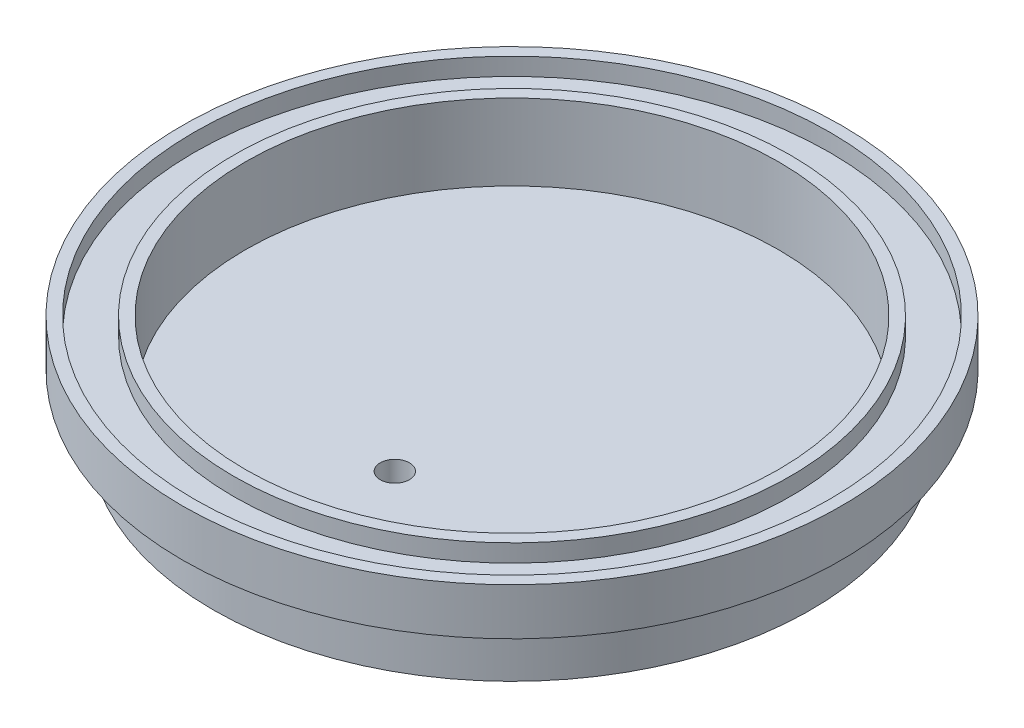
ISO-10303-21;
HEADER;
FILE_DESCRIPTION(('STEP AP214'),'2;1');
FILE_NAME('part.step','',(''),(''),'','','');
FILE_SCHEMA(('AUTOMOTIVE_DESIGN { 1 0 10303 214 1 1 1 1 }'));
ENDSEC;
DATA;
#1=APPLICATION_CONTEXT('core data for automotive mechanical design processes');
#2=APPLICATION_PROTOCOL_DEFINITION('international standard','automotive_design',2000,#1);
#3=PRODUCT_CONTEXT('',#1,'mechanical');
#4=PRODUCT('Part','Part','',(#3));
#5=PRODUCT_RELATED_PRODUCT_CATEGORY('part','',(#4));
#6=PRODUCT_DEFINITION_FORMATION('','',#4);
#7=PRODUCT_DEFINITION_CONTEXT('part definition',#1,'design');
#8=PRODUCT_DEFINITION('design','',#6,#7);
#9=PRODUCT_DEFINITION_SHAPE('','',#8);
#10=(LENGTH_UNIT() NAMED_UNIT(*) SI_UNIT(.MILLI.,.METRE.));
#11=(NAMED_UNIT(*) PLANE_ANGLE_UNIT() SI_UNIT($,.RADIAN.));
#12=(NAMED_UNIT(*) SI_UNIT($,.STERADIAN.) SOLID_ANGLE_UNIT());
#13=UNCERTAINTY_MEASURE_WITH_UNIT(LENGTH_MEASURE(1.E-05),#10,'distance_accuracy_value','');
#14=(GEOMETRIC_REPRESENTATION_CONTEXT(3) GLOBAL_UNCERTAINTY_ASSIGNED_CONTEXT((#13)) GLOBAL_UNIT_ASSIGNED_CONTEXT((#10,
#11,#12)) REPRESENTATION_CONTEXT('',''));
#15=CARTESIAN_POINT('',(0.,0.,0.));
#16=DIRECTION('',(0.,0.,1.));
#17=DIRECTION('',(1.,0.,0.));
#18=AXIS2_PLACEMENT_3D('',#15,#16,#17);
#19=CARTESIAN_POINT('',(0.,-5.,0.));
#20=DIRECTION('',(0.,1.,0.));
#21=DIRECTION('',(0.,0.,1.));
#22=AXIS2_PLACEMENT_3D('',#19,#20,#21);
#23=PLANE('',#22);
#24=CARTESIAN_POINT('',(0.,-5.,0.));
#25=DIRECTION('',(0.,1.,0.));
#26=DIRECTION('',(0.,0.,1.));
#27=AXIS2_PLACEMENT_3D('',#24,#25,#26);
#28=CIRCLE('',#27,56.25);
#29=CARTESIAN_POINT('',(0.,-5.,56.25));
#30=VERTEX_POINT('',#29);
#31=EDGE_CURVE('E126',#30,#30,#28,.T.);
#32=ORIENTED_EDGE('',*,*,#31,.F.);
#33=EDGE_LOOP('',(#32));
#34=FACE_BOUND('',#33,.T.);
#35=DIRECTION('',(0.,0.,-1.));
#36=VECTOR('',#35,1.);
#37=CARTESIAN_POINT('',(-2.34999999999999,-5.,-51.));
#38=LINE('',#37,#36);
#39=CARTESIAN_POINT('',(-2.34999999999999,-5.,-50.9458290736347));
#40=VERTEX_POINT('',#39);
#41=CARTESIAN_POINT('',(-2.34999999999999,-5.,-56.));
#42=VERTEX_POINT('',#41);
#43=EDGE_CURVE('E98',#40,#42,#38,.T.);
#44=ORIENTED_EDGE('',*,*,#43,.F.);
#45=CARTESIAN_POINT('',(0.,-5.,0.));
#46=DIRECTION('',(0.,1.,0.));
#47=DIRECTION('',(0.,0.,1.));
#48=AXIS2_PLACEMENT_3D('',#45,#46,#47);
#49=CIRCLE('',#48,51.);
#50=CARTESIAN_POINT('',(2.35000000000001,-5.,-50.9458290736347));
#51=VERTEX_POINT('',#50);
#52=EDGE_CURVE('E118',#40,#51,#49,.T.);
#53=ORIENTED_EDGE('',*,*,#52,.T.);
#54=DIRECTION('',(0.,0.,1.));
#55=VECTOR('',#54,1.);
#56=CARTESIAN_POINT('',(2.35000000000001,-5.,-51.));
#57=LINE('',#56,#55);
#58=CARTESIAN_POINT('',(2.35000000000001,-5.,-56.));
#59=VERTEX_POINT('',#58);
#60=EDGE_CURVE('E92',#59,#51,#57,.T.);
#61=ORIENTED_EDGE('',*,*,#60,.F.);
#62=DIRECTION('',(1.,0.,0.));
#63=VECTOR('',#62,1.);
#64=CARTESIAN_POINT('',(-2.34999999999999,-5.,-56.));
#65=LINE('',#64,#63);
#66=EDGE_CURVE('E111',#42,#59,#65,.T.);
#67=ORIENTED_EDGE('',*,*,#66,.F.);
#68=EDGE_LOOP('',(#44,#53,#61,#67));
#69=FACE_BOUND('',#68,.T.);
#70=ADVANCED_FACE('F48',(#34,#69),#23,.F.);
#71=CARTESIAN_POINT('',(0.,-15.,0.));
#72=DIRECTION('',(0.,1.,0.));
#73=DIRECTION('',(0.,0.,1.));
#74=AXIS2_PLACEMENT_3D('',#71,#72,#73);
#75=CYLINDRICAL_SURFACE('',#74,51.);
#76=CARTESIAN_POINT('',(0.,-15.,0.));
#77=DIRECTION('',(0.,1.,0.));
#78=DIRECTION('',(0.,0.,1.));
#79=AXIS2_PLACEMENT_3D('',#76,#77,#78);
#80=CIRCLE('',#79,51.);
#81=CARTESIAN_POINT('',(0.,-15.,51.));
#82=VERTEX_POINT('',#81);
#83=EDGE_CURVE('E101',#82,#82,#80,.T.);
#84=ORIENTED_EDGE('',*,*,#83,.T.);
#85=EDGE_LOOP('',(#84));
#86=FACE_BOUND('',#85,.T.);
#87=ORIENTED_EDGE('',*,*,#52,.F.);
#88=DIRECTION('',(0.,1.,0.));
#89=VECTOR('',#88,1.);
#90=CARTESIAN_POINT('',(-2.34999999999999,-15.,-50.9458290736347));
#91=LINE('',#90,#89);
#92=CARTESIAN_POINT('',(-2.34999999999999,-10.,-50.9458290736347));
#93=VERTEX_POINT('',#92);
#94=EDGE_CURVE('E12',#40,#93,#91,.F.);
#95=ORIENTED_EDGE('',*,*,#94,.T.);
#96=CARTESIAN_POINT('',(0.,-10.,0.));
#97=DIRECTION('',(0.,1.,0.));
#98=DIRECTION('',(0.,0.,1.));
#99=AXIS2_PLACEMENT_3D('',#96,#97,#98);
#100=CIRCLE('',#99,51.);
#101=CARTESIAN_POINT('',(2.35000000000001,-10.,-50.9458290736347));
#102=VERTEX_POINT('',#101);
#103=EDGE_CURVE('E68',#93,#102,#100,.F.);
#104=ORIENTED_EDGE('',*,*,#103,.T.);
#105=DIRECTION('',(0.,1.,0.));
#106=VECTOR('',#105,1.);
#107=CARTESIAN_POINT('',(2.35000000000001,-15.,-50.9458290736347));
#108=LINE('',#107,#106);
#109=EDGE_CURVE('E56',#102,#51,#108,.T.);
#110=ORIENTED_EDGE('',*,*,#109,.T.);
#111=EDGE_LOOP('',(#87,#95,#104,#110));
#112=FACE_BOUND('',#111,.T.);
#113=ADVANCED_FACE('F145',(#86,#112),#75,.T.);
#114=CARTESIAN_POINT('',(0.,3.,0.));
#115=DIRECTION('',(0.,-1.,0.));
#116=DIRECTION('',(0.,0.,-1.));
#117=AXIS2_PLACEMENT_3D('',#114,#115,#116);
#118=CYLINDRICAL_SURFACE('',#117,54.25);
#119=CARTESIAN_POINT('',(0.,3.,0.));
#120=DIRECTION('',(0.,1.,0.));
#121=DIRECTION('',(0.,0.,1.));
#122=AXIS2_PLACEMENT_3D('',#119,#120,#121);
#123=CIRCLE('',#122,54.25);
#124=CARTESIAN_POINT('',(0.,3.,54.25));
#125=VERTEX_POINT('',#124);
#126=EDGE_CURVE('E132',#125,#125,#123,.T.);
#127=ORIENTED_EDGE('',*,*,#126,.T.);
#128=EDGE_LOOP('',(#127));
#129=FACE_BOUND('',#128,.T.);
#130=CARTESIAN_POINT('',(0.,0.,0.));
#131=DIRECTION('',(0.,1.,0.));
#132=DIRECTION('',(0.,0.,1.));
#133=AXIS2_PLACEMENT_3D('',#130,#131,#132);
#134=CIRCLE('',#133,54.25);
#135=CARTESIAN_POINT('',(0.,0.,54.25));
#136=VERTEX_POINT('',#135);
#137=EDGE_CURVE('E131',#136,#136,#134,.T.);
#138=ORIENTED_EDGE('',*,*,#137,.F.);
#139=EDGE_LOOP('',(#138));
#140=FACE_BOUND('',#139,.T.);
#141=ADVANCED_FACE('F50',(#129,#140),#118,.F.);
#142=CARTESIAN_POINT('',(0.,3.,0.));
#143=DIRECTION('',(0.,-1.,0.));
#144=DIRECTION('',(0.,0.,-1.));
#145=AXIS2_PLACEMENT_3D('',#142,#143,#144);
#146=CYLINDRICAL_SURFACE('',#145,56.25);
#147=CARTESIAN_POINT('',(0.,3.,0.));
#148=DIRECTION('',(0.,1.,0.));
#149=DIRECTION('',(0.,0.,1.));
#150=AXIS2_PLACEMENT_3D('',#147,#148,#149);
#151=CIRCLE('',#150,56.25);
#152=CARTESIAN_POINT('',(0.,3.,56.25));
#153=VERTEX_POINT('',#152);
#154=EDGE_CURVE('E135',#153,#153,#151,.T.);
#155=ORIENTED_EDGE('',*,*,#154,.F.);
#156=EDGE_LOOP('',(#155));
#157=FACE_BOUND('',#156,.T.);
#158=ORIENTED_EDGE('',*,*,#31,.T.);
#159=EDGE_LOOP('',(#158));
#160=FACE_BOUND('',#159,.T.);
#161=ADVANCED_FACE('F179',(#157,#160),#146,.T.);
#162=CARTESIAN_POINT('',(0.,3.,0.));
#163=DIRECTION('',(0.,1.,0.));
#164=DIRECTION('',(0.,0.,1.));
#165=AXIS2_PLACEMENT_3D('',#162,#163,#164);
#166=PLANE('',#165);
#167=ORIENTED_EDGE('',*,*,#126,.F.);
#168=EDGE_LOOP('',(#167));
#169=FACE_BOUND('',#168,.T.);
#170=ORIENTED_EDGE('',*,*,#154,.T.);
#171=EDGE_LOOP('',(#170));
#172=FACE_BOUND('',#171,.T.);
#173=ADVANCED_FACE('F176',(#169,#172),#166,.T.);
#174=CARTESIAN_POINT('',(0.,0.,0.));
#175=DIRECTION('',(0.,1.,0.));
#176=DIRECTION('',(0.,0.,1.));
#177=AXIS2_PLACEMENT_3D('',#174,#175,#176);
#178=PLANE('',#177);
#179=ORIENTED_EDGE('',*,*,#137,.T.);
#180=EDGE_LOOP('',(#179));
#181=FACE_BOUND('',#180,.T.);
#182=CARTESIAN_POINT('',(0.,0.,0.));
#183=DIRECTION('',(0.,1.,0.));
#184=DIRECTION('',(0.,0.,1.));
#185=AXIS2_PLACEMENT_3D('',#182,#183,#184);
#186=CIRCLE('',#185,47.5);
#187=CARTESIAN_POINT('',(0.,0.,47.5));
#188=VERTEX_POINT('',#187);
#189=EDGE_CURVE('E123',#188,#188,#186,.T.);
#190=ORIENTED_EDGE('',*,*,#189,.F.);
#191=EDGE_LOOP('',(#190));
#192=FACE_BOUND('',#191,.T.);
#193=ADVANCED_FACE('F173',(#181,#192),#178,.T.);
#194=CARTESIAN_POINT('',(0.,3.,0.));
#195=DIRECTION('',(0.,-1.,0.));
#196=DIRECTION('',(0.,0.,-1.));
#197=AXIS2_PLACEMENT_3D('',#194,#195,#196);
#198=CYLINDRICAL_SURFACE('',#197,45.5);
#199=CARTESIAN_POINT('',(0.,3.,0.));
#200=DIRECTION('',(0.,1.,0.));
#201=DIRECTION('',(0.,0.,1.));
#202=AXIS2_PLACEMENT_3D('',#199,#200,#201);
#203=CIRCLE('',#202,45.5);
#204=CARTESIAN_POINT('',(0.,3.,45.5));
#205=VERTEX_POINT('',#204);
#206=EDGE_CURVE('E119',#205,#205,#203,.T.);
#207=ORIENTED_EDGE('',*,*,#206,.T.);
#208=EDGE_LOOP('',(#207));
#209=FACE_BOUND('',#208,.T.);
#210=CARTESIAN_POINT('',(0.,-10.,0.));
#211=DIRECTION('',(0.,1.,0.));
#212=DIRECTION('',(0.,0.,1.));
#213=AXIS2_PLACEMENT_3D('',#210,#211,#212);
#214=CIRCLE('',#213,45.5);
#215=CARTESIAN_POINT('',(0.,-10.,45.5));
#216=VERTEX_POINT('',#215);
#217=EDGE_CURVE('E112',#216,#216,#214,.T.);
#218=ORIENTED_EDGE('',*,*,#217,.F.);
#219=EDGE_LOOP('',(#218));
#220=FACE_BOUND('',#219,.T.);
#221=ADVANCED_FACE('F171',(#209,#220),#198,.F.);
#222=CARTESIAN_POINT('',(0.,3.,0.));
#223=DIRECTION('',(0.,-1.,0.));
#224=DIRECTION('',(0.,0.,-1.));
#225=AXIS2_PLACEMENT_3D('',#222,#223,#224);
#226=CYLINDRICAL_SURFACE('',#225,47.5);
#227=CARTESIAN_POINT('',(0.,3.,0.));
#228=DIRECTION('',(0.,1.,0.));
#229=DIRECTION('',(0.,0.,1.));
#230=AXIS2_PLACEMENT_3D('',#227,#228,#229);
#231=CIRCLE('',#230,47.5);
#232=CARTESIAN_POINT('',(0.,3.,47.5));
#233=VERTEX_POINT('',#232);
#234=EDGE_CURVE('E122',#233,#233,#231,.T.);
#235=ORIENTED_EDGE('',*,*,#234,.F.);
#236=EDGE_LOOP('',(#235));
#237=FACE_BOUND('',#236,.T.);
#238=ORIENTED_EDGE('',*,*,#189,.T.);
#239=EDGE_LOOP('',(#238));
#240=FACE_BOUND('',#239,.T.);
#241=ADVANCED_FACE('F198',(#237,#240),#226,.T.);
#242=CARTESIAN_POINT('',(0.,3.,0.));
#243=DIRECTION('',(0.,1.,0.));
#244=DIRECTION('',(0.,0.,1.));
#245=AXIS2_PLACEMENT_3D('',#242,#243,#244);
#246=PLANE('',#245);
#247=ORIENTED_EDGE('',*,*,#206,.F.);
#248=EDGE_LOOP('',(#247));
#249=FACE_BOUND('',#248,.T.);
#250=ORIENTED_EDGE('',*,*,#234,.T.);
#251=EDGE_LOOP('',(#250));
#252=FACE_BOUND('',#251,.T.);
#253=ADVANCED_FACE('F200',(#249,#252),#246,.T.);
#254=CARTESIAN_POINT('',(0.,-15.,0.));
#255=DIRECTION('',(0.,1.,0.));
#256=DIRECTION('',(0.,0.,1.));
#257=AXIS2_PLACEMENT_3D('',#254,#255,#256);
#258=PLANE('',#257);
#259=CARTESIAN_POINT('',(0.,-15.,20.));
#260=DIRECTION('',(0.,1.,0.));
#261=DIRECTION('',(0.,0.,1.));
#262=AXIS2_PLACEMENT_3D('',#259,#260,#261);
#263=CIRCLE('',#262,2.5);
#264=CARTESIAN_POINT('',(0.,-15.,22.5));
#265=VERTEX_POINT('',#264);
#266=EDGE_CURVE('E272',#265,#265,#263,.T.);
#267=ORIENTED_EDGE('',*,*,#266,.T.);
#268=EDGE_LOOP('',(#267));
#269=FACE_BOUND('',#268,.T.);
#270=ORIENTED_EDGE('',*,*,#83,.F.);
#271=EDGE_LOOP('',(#270));
#272=FACE_BOUND('',#271,.T.);
#273=ADVANCED_FACE('F204',(#269,#272),#258,.F.);
#274=CARTESIAN_POINT('',(-2.34999999999999,-10.,-51.));
#275=DIRECTION('',(1.,0.,0.));
#276=DIRECTION('',(0.,0.,-1.));
#277=AXIS2_PLACEMENT_3D('',#274,#275,#276);
#278=PLANE('',#277);
#279=ORIENTED_EDGE('',*,*,#94,.F.);
#280=ORIENTED_EDGE('',*,*,#43,.T.);
#281=DIRECTION('',(0.,1.,0.));
#282=VECTOR('',#281,1.);
#283=CARTESIAN_POINT('',(-2.34999999999999,-10.,-56.));
#284=LINE('',#283,#282);
#285=CARTESIAN_POINT('',(-2.34999999999999,-10.,-56.));
#286=VERTEX_POINT('',#285);
#287=EDGE_CURVE('E95',#286,#42,#284,.T.);
#288=ORIENTED_EDGE('',*,*,#287,.F.);
#289=DIRECTION('',(0.,0.,-1.));
#290=VECTOR('',#289,1.);
#291=CARTESIAN_POINT('',(-2.34999999999999,-10.,-51.));
#292=LINE('',#291,#290);
#293=EDGE_CURVE('E85',#93,#286,#292,.T.);
#294=ORIENTED_EDGE('',*,*,#293,.F.);
#295=EDGE_LOOP('',(#279,#280,#288,#294));
#296=FACE_BOUND('',#295,.T.);
#297=ADVANCED_FACE('F96',(#296),#278,.F.);
#298=CARTESIAN_POINT('',(-2.34999999999999,-10.,-56.));
#299=DIRECTION('',(0.,0.,1.));
#300=DIRECTION('',(1.,0.,0.));
#301=AXIS2_PLACEMENT_3D('',#298,#299,#300);
#302=PLANE('',#301);
#303=ORIENTED_EDGE('',*,*,#66,.T.);
#304=DIRECTION('',(0.,1.,0.));
#305=VECTOR('',#304,1.);
#306=CARTESIAN_POINT('',(2.35000000000001,-10.,-56.));
#307=LINE('',#306,#305);
#308=CARTESIAN_POINT('',(2.35000000000001,-10.,-56.));
#309=VERTEX_POINT('',#308);
#310=EDGE_CURVE('E102',#309,#59,#307,.T.);
#311=ORIENTED_EDGE('',*,*,#310,.F.);
#312=DIRECTION('',(1.,0.,0.));
#313=VECTOR('',#312,1.);
#314=CARTESIAN_POINT('',(-2.34999999999999,-10.,-56.));
#315=LINE('',#314,#313);
#316=EDGE_CURVE('E89',#286,#309,#315,.T.);
#317=ORIENTED_EDGE('',*,*,#316,.F.);
#318=ORIENTED_EDGE('',*,*,#287,.T.);
#319=EDGE_LOOP('',(#303,#311,#317,#318));
#320=FACE_BOUND('',#319,.T.);
#321=ADVANCED_FACE('F104',(#320),#302,.F.);
#322=CARTESIAN_POINT('',(2.35000000000001,-10.,-51.));
#323=DIRECTION('',(-1.,0.,0.));
#324=DIRECTION('',(0.,0.,1.));
#325=AXIS2_PLACEMENT_3D('',#322,#323,#324);
#326=PLANE('',#325);
#327=ORIENTED_EDGE('',*,*,#109,.F.);
#328=DIRECTION('',(0.,0.,1.));
#329=VECTOR('',#328,1.);
#330=CARTESIAN_POINT('',(2.35000000000001,-10.,-51.));
#331=LINE('',#330,#329);
#332=EDGE_CURVE('E63',#309,#102,#331,.T.);
#333=ORIENTED_EDGE('',*,*,#332,.F.);
#334=ORIENTED_EDGE('',*,*,#310,.T.);
#335=ORIENTED_EDGE('',*,*,#60,.T.);
#336=EDGE_LOOP('',(#327,#333,#334,#335));
#337=FACE_BOUND('',#336,.T.);
#338=ADVANCED_FACE('F149',(#337),#326,.F.);
#339=CARTESIAN_POINT('',(0.,-10.,0.));
#340=DIRECTION('',(0.,1.,0.));
#341=DIRECTION('',(0.,0.,1.));
#342=AXIS2_PLACEMENT_3D('',#339,#340,#341);
#343=PLANE('',#342);
#344=ORIENTED_EDGE('',*,*,#103,.F.);
#345=ORIENTED_EDGE('',*,*,#293,.T.);
#346=ORIENTED_EDGE('',*,*,#316,.T.);
#347=ORIENTED_EDGE('',*,*,#332,.T.);
#348=EDGE_LOOP('',(#344,#345,#346,#347));
#349=FACE_BOUND('',#348,.T.);
#350=ADVANCED_FACE('F87',(#349),#343,.F.);
#351=CARTESIAN_POINT('',(0.,-10.,0.));
#352=DIRECTION('',(0.,1.,0.));
#353=DIRECTION('',(0.,0.,1.));
#354=AXIS2_PLACEMENT_3D('',#351,#352,#353);
#355=PLANE('',#354);
#356=CARTESIAN_POINT('',(0.,-10.,20.));
#357=DIRECTION('',(0.,1.,0.));
#358=DIRECTION('',(0.,0.,1.));
#359=AXIS2_PLACEMENT_3D('',#356,#357,#358);
#360=CIRCLE('',#359,2.5);
#361=CARTESIAN_POINT('',(0.,-10.,22.5));
#362=VERTEX_POINT('',#361);
#363=EDGE_CURVE('E275',#362,#362,#360,.T.);
#364=ORIENTED_EDGE('',*,*,#363,.F.);
#365=EDGE_LOOP('',(#364));
#366=FACE_BOUND('',#365,.T.);
#367=ORIENTED_EDGE('',*,*,#217,.T.);
#368=EDGE_LOOP('',(#367));
#369=FACE_BOUND('',#368,.T.);
#370=ADVANCED_FACE('F156',(#366,#369),#355,.T.);
#371=CARTESIAN_POINT('',(0.,-15.,20.));
#372=DIRECTION('',(0.,1.,0.));
#373=DIRECTION('',(0.,0.,1.));
#374=AXIS2_PLACEMENT_3D('',#371,#372,#373);
#375=CYLINDRICAL_SURFACE('',#374,2.5);
#376=ORIENTED_EDGE('',*,*,#266,.F.);
#377=EDGE_LOOP('',(#376));
#378=FACE_BOUND('',#377,.T.);
#379=ORIENTED_EDGE('',*,*,#363,.T.);
#380=EDGE_LOOP('',(#379));
#381=FACE_BOUND('',#380,.T.);
#382=ADVANCED_FACE('F256',(#378,#381),#375,.F.);
#383=CLOSED_SHELL('',(#70,#113,#141,#161,#173,#193,#221,#241,#253,#273,#297,#321,#338,#350,#370,#382));
#384=MANIFOLD_SOLID_BREP('B2',#383);
#385=ADVANCED_BREP_SHAPE_REPRESENTATION('',(#18,#384),#14);
#386=SHAPE_DEFINITION_REPRESENTATION(#9,#385);
ENDSEC;
END-ISO-10303-21;
